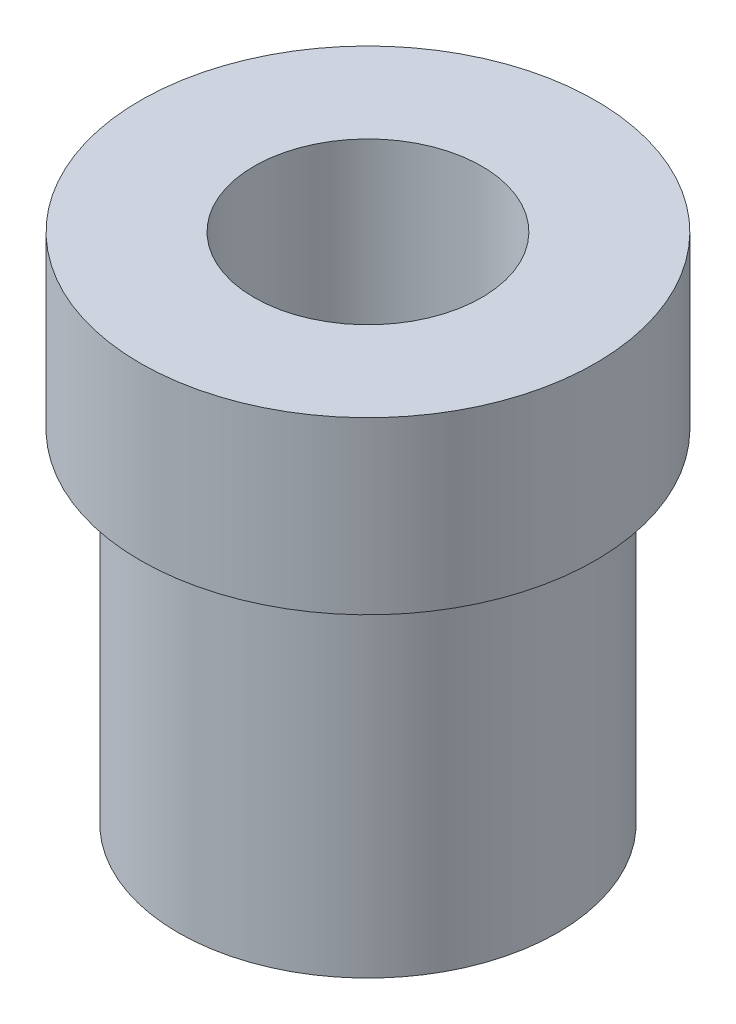
ISO-10303-21;
HEADER;
FILE_DESCRIPTION(('STEP AP214'),'2;1');
FILE_NAME('part.step','',(''),(''),'','','');
FILE_SCHEMA(('AUTOMOTIVE_DESIGN { 1 0 10303 214 1 1 1 1 }'));
ENDSEC;
DATA;
#1=APPLICATION_CONTEXT('core data for automotive mechanical design processes');
#2=APPLICATION_PROTOCOL_DEFINITION('international standard','automotive_design',2000,#1);
#3=PRODUCT_CONTEXT('',#1,'mechanical');
#4=PRODUCT('Part','Part','',(#3));
#5=PRODUCT_RELATED_PRODUCT_CATEGORY('part','',(#4));
#6=PRODUCT_DEFINITION_FORMATION('','',#4);
#7=PRODUCT_DEFINITION_CONTEXT('part definition',#1,'design');
#8=PRODUCT_DEFINITION('design','',#6,#7);
#9=PRODUCT_DEFINITION_SHAPE('','',#8);
#10=(LENGTH_UNIT() NAMED_UNIT(*) SI_UNIT(.MILLI.,.METRE.));
#11=(NAMED_UNIT(*) PLANE_ANGLE_UNIT() SI_UNIT($,.RADIAN.));
#12=(NAMED_UNIT(*) SI_UNIT($,.STERADIAN.) SOLID_ANGLE_UNIT());
#13=UNCERTAINTY_MEASURE_WITH_UNIT(LENGTH_MEASURE(1.E-05),#10,'distance_accuracy_value','');
#14=(GEOMETRIC_REPRESENTATION_CONTEXT(3) GLOBAL_UNCERTAINTY_ASSIGNED_CONTEXT((#13)) GLOBAL_UNIT_ASSIGNED_CONTEXT((#10,
#11,#12)) REPRESENTATION_CONTEXT('',''));
#15=CARTESIAN_POINT('',(0.,0.,0.));
#16=DIRECTION('',(0.,0.,1.));
#17=DIRECTION('',(1.,0.,0.));
#18=AXIS2_PLACEMENT_3D('',#15,#16,#17);
#19=CARTESIAN_POINT('',(0.,9.,0.));
#20=DIRECTION('',(0.,-1.,0.));
#21=DIRECTION('',(0.,0.,-1.));
#22=AXIS2_PLACEMENT_3D('',#19,#20,#21);
#23=CYLINDRICAL_SURFACE('',#22,5.);
#24=CARTESIAN_POINT('',(0.,9.,0.));
#25=DIRECTION('',(0.,1.,0.));
#26=DIRECTION('',(0.,0.,1.));
#27=AXIS2_PLACEMENT_3D('',#24,#25,#26);
#28=CIRCLE('',#27,5.);
#29=CARTESIAN_POINT('',(0.,9.,5.));
#30=VERTEX_POINT('',#29);
#31=EDGE_CURVE('E10',#30,#30,#28,.T.);
#32=ORIENTED_EDGE('',*,*,#31,.F.);
#33=EDGE_LOOP('',(#32));
#34=FACE_BOUND('',#33,.T.);
#35=CARTESIAN_POINT('',(0.,0.,0.));
#36=DIRECTION('',(0.,1.,0.));
#37=DIRECTION('',(0.,0.,1.));
#38=AXIS2_PLACEMENT_3D('',#35,#36,#37);
#39=CIRCLE('',#38,5.);
#40=CARTESIAN_POINT('',(0.,0.,5.));
#41=VERTEX_POINT('',#40);
#42=EDGE_CURVE('E38',#41,#41,#39,.T.);
#43=ORIENTED_EDGE('',*,*,#42,.T.);
#44=EDGE_LOOP('',(#43));
#45=FACE_BOUND('',#44,.T.);
#46=ADVANCED_FACE('F31',(#34,#45),#23,.T.);
#47=CARTESIAN_POINT('',(0.,0.,0.));
#48=DIRECTION('',(0.,1.,0.));
#49=DIRECTION('',(0.,0.,1.));
#50=AXIS2_PLACEMENT_3D('',#47,#48,#49);
#51=PLANE('',#50);
#52=CARTESIAN_POINT('',(0.,0.,0.));
#53=DIRECTION('',(0.,1.,0.));
#54=DIRECTION('',(0.,0.,1.));
#55=AXIS2_PLACEMENT_3D('',#52,#53,#54);
#56=CIRCLE('',#55,3.);
#57=CARTESIAN_POINT('',(0.,0.,3.));
#58=VERTEX_POINT('',#57);
#59=EDGE_CURVE('E50',#58,#58,#56,.T.);
#60=ORIENTED_EDGE('',*,*,#59,.T.);
#61=EDGE_LOOP('',(#60));
#62=FACE_BOUND('',#61,.T.);
#63=ORIENTED_EDGE('',*,*,#42,.F.);
#64=EDGE_LOOP('',(#63));
#65=FACE_BOUND('',#64,.T.);
#66=ADVANCED_FACE('F70',(#62,#65),#51,.F.);
#67=CARTESIAN_POINT('',(0.,13.5,0.));
#68=DIRECTION('',(0.,-1.,0.));
#69=DIRECTION('',(0.,0.,-1.));
#70=AXIS2_PLACEMENT_3D('',#67,#68,#69);
#71=CYLINDRICAL_SURFACE('',#70,6.);
#72=CARTESIAN_POINT('',(0.,13.5,0.));
#73=DIRECTION('',(0.,1.,0.));
#74=DIRECTION('',(0.,0.,1.));
#75=AXIS2_PLACEMENT_3D('',#72,#73,#74);
#76=CIRCLE('',#75,6.);
#77=CARTESIAN_POINT('',(0.,13.5,6.));
#78=VERTEX_POINT('',#77);
#79=EDGE_CURVE('E43',#78,#78,#76,.T.);
#80=ORIENTED_EDGE('',*,*,#79,.F.);
#81=EDGE_LOOP('',(#80));
#82=FACE_BOUND('',#81,.T.);
#83=CARTESIAN_POINT('',(0.,9.,0.));
#84=DIRECTION('',(0.,1.,0.));
#85=DIRECTION('',(0.,0.,1.));
#86=AXIS2_PLACEMENT_3D('',#83,#84,#85);
#87=CIRCLE('',#86,6.);
#88=CARTESIAN_POINT('',(0.,9.,6.));
#89=VERTEX_POINT('',#88);
#90=EDGE_CURVE('E45',#89,#89,#87,.T.);
#91=ORIENTED_EDGE('',*,*,#90,.T.);
#92=EDGE_LOOP('',(#91));
#93=FACE_BOUND('',#92,.T.);
#94=ADVANCED_FACE('F64',(#82,#93),#71,.T.);
#95=CARTESIAN_POINT('',(0.,13.5,0.));
#96=DIRECTION('',(0.,1.,0.));
#97=DIRECTION('',(0.,0.,1.));
#98=AXIS2_PLACEMENT_3D('',#95,#96,#97);
#99=PLANE('',#98);
#100=CARTESIAN_POINT('',(0.,13.5,0.));
#101=DIRECTION('',(0.,1.,0.));
#102=DIRECTION('',(0.,0.,1.));
#103=AXIS2_PLACEMENT_3D('',#100,#101,#102);
#104=CIRCLE('',#103,3.);
#105=CARTESIAN_POINT('',(0.,13.5,3.));
#106=VERTEX_POINT('',#105);
#107=EDGE_CURVE('E34',#106,#106,#104,.T.);
#108=ORIENTED_EDGE('',*,*,#107,.F.);
#109=EDGE_LOOP('',(#108));
#110=FACE_BOUND('',#109,.T.);
#111=ORIENTED_EDGE('',*,*,#79,.T.);
#112=EDGE_LOOP('',(#111));
#113=FACE_BOUND('',#112,.T.);
#114=ADVANCED_FACE('F60',(#110,#113),#99,.T.);
#115=CARTESIAN_POINT('',(0.,9.,0.));
#116=DIRECTION('',(0.,1.,0.));
#117=DIRECTION('',(0.,0.,1.));
#118=AXIS2_PLACEMENT_3D('',#115,#116,#117);
#119=PLANE('',#118);
#120=ORIENTED_EDGE('',*,*,#31,.T.);
#121=EDGE_LOOP('',(#120));
#122=FACE_BOUND('',#121,.T.);
#123=ORIENTED_EDGE('',*,*,#90,.F.);
#124=EDGE_LOOP('',(#123));
#125=FACE_BOUND('',#124,.T.);
#126=ADVANCED_FACE('F63',(#122,#125),#119,.F.);
#127=CARTESIAN_POINT('',(0.,0.,0.));
#128=DIRECTION('',(0.,1.,0.));
#129=DIRECTION('',(0.,0.,1.));
#130=AXIS2_PLACEMENT_3D('',#127,#128,#129);
#131=CYLINDRICAL_SURFACE('',#130,3.);
#132=ORIENTED_EDGE('',*,*,#107,.T.);
#133=EDGE_LOOP('',(#132));
#134=FACE_BOUND('',#133,.T.);
#135=ORIENTED_EDGE('',*,*,#59,.F.);
#136=EDGE_LOOP('',(#135));
#137=FACE_BOUND('',#136,.T.);
#138=ADVANCED_FACE('F57',(#134,#137),#131,.F.);
#139=CLOSED_SHELL('',(#46,#66,#94,#114,#126,#138));
#140=MANIFOLD_SOLID_BREP('B2',#139);
#141=ADVANCED_BREP_SHAPE_REPRESENTATION('',(#18,#140),#14);
#142=SHAPE_DEFINITION_REPRESENTATION(#9,#141);
ENDSEC;
END-ISO-10303-21;
